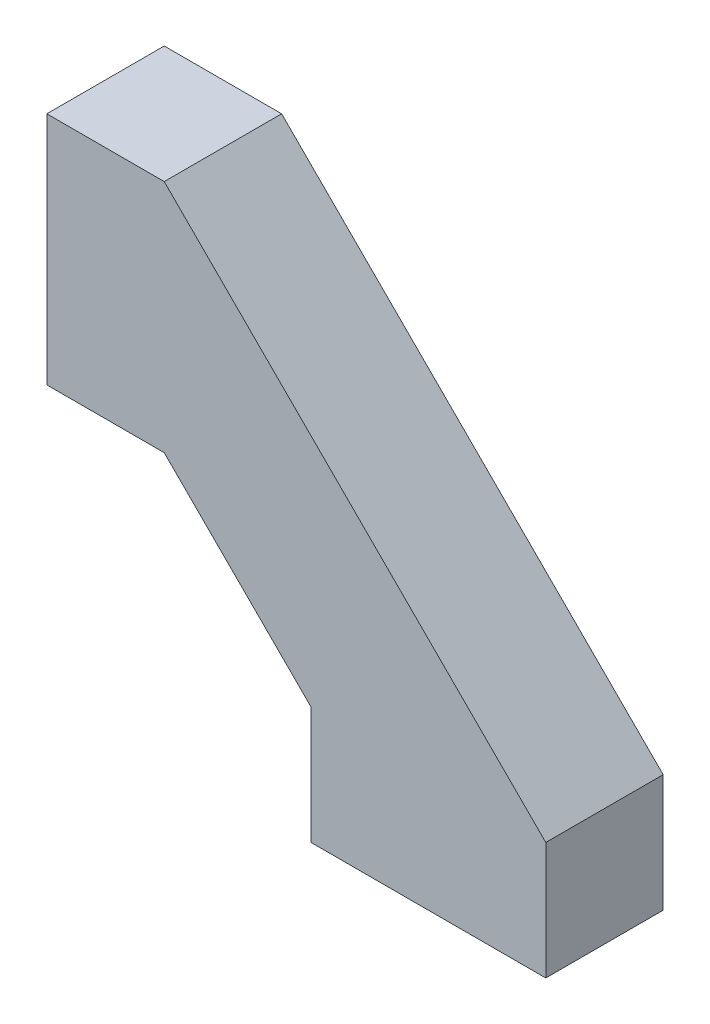
ISO-10303-21;
HEADER;
FILE_DESCRIPTION(('STEP AP214'),'2;1');
FILE_NAME('part.step','',(''),(''),'','','');
FILE_SCHEMA(('AUTOMOTIVE_DESIGN { 1 0 10303 214 1 1 1 1 }'));
ENDSEC;
DATA;
#1=APPLICATION_CONTEXT('core data for automotive mechanical design processes');
#2=APPLICATION_PROTOCOL_DEFINITION('international standard','automotive_design',2000,#1);
#3=PRODUCT_CONTEXT('',#1,'mechanical');
#4=PRODUCT('Part','Part','',(#3));
#5=PRODUCT_RELATED_PRODUCT_CATEGORY('part','',(#4));
#6=PRODUCT_DEFINITION_FORMATION('','',#4);
#7=PRODUCT_DEFINITION_CONTEXT('part definition',#1,'design');
#8=PRODUCT_DEFINITION('design','',#6,#7);
#9=PRODUCT_DEFINITION_SHAPE('','',#8);
#10=(LENGTH_UNIT() NAMED_UNIT(*) SI_UNIT(.MILLI.,.METRE.));
#11=(NAMED_UNIT(*) PLANE_ANGLE_UNIT() SI_UNIT($,.RADIAN.));
#12=(NAMED_UNIT(*) SI_UNIT($,.STERADIAN.) SOLID_ANGLE_UNIT());
#13=UNCERTAINTY_MEASURE_WITH_UNIT(LENGTH_MEASURE(1.E-05),#10,'distance_accuracy_value','');
#14=(GEOMETRIC_REPRESENTATION_CONTEXT(3) GLOBAL_UNCERTAINTY_ASSIGNED_CONTEXT((#13)) GLOBAL_UNIT_ASSIGNED_CONTEXT((#10,
#11,#12)) REPRESENTATION_CONTEXT('',''));
#15=CARTESIAN_POINT('',(0.,0.,0.));
#16=DIRECTION('',(0.,0.,1.));
#17=DIRECTION('',(1.,0.,0.));
#18=AXIS2_PLACEMENT_3D('',#15,#16,#17);
#19=CARTESIAN_POINT('',(2.,2.00000000000001,4.));
#20=DIRECTION('',(-0.707106781186546,-0.707106781186549,0.));
#21=DIRECTION('',(0.707106781186549,-0.707106781186546,0.));
#22=AXIS2_PLACEMENT_3D('',#19,#20,#21);
#23=PLANE('',#22);
#24=DIRECTION('',(-0.707106781186549,0.707106781186546,0.));
#25=VECTOR('',#24,1.);
#26=CARTESIAN_POINT('',(2.,2.00000000000001,0.));
#27=LINE('',#26,#25);
#28=CARTESIAN_POINT('',(0.,4.,0.));
#29=VERTEX_POINT('',#28);
#30=CARTESIAN_POINT('',(-13.,17.,0.));
#31=VERTEX_POINT('',#30);
#32=EDGE_CURVE('E130',#29,#31,#27,.T.);
#33=ORIENTED_EDGE('',*,*,#32,.T.);
#34=DIRECTION('',(0.,0.,-1.));
#35=VECTOR('',#34,1.);
#36=CARTESIAN_POINT('',(-13.,17.,4.));
#37=LINE('',#36,#35);
#38=CARTESIAN_POINT('',(-13.,17.,4.));
#39=VERTEX_POINT('',#38);
#40=EDGE_CURVE('E11',#39,#31,#37,.T.);
#41=ORIENTED_EDGE('',*,*,#40,.F.);
#42=DIRECTION('',(-0.707106781186549,0.707106781186546,0.));
#43=VECTOR('',#42,1.);
#44=CARTESIAN_POINT('',(2.,2.00000000000001,4.));
#45=LINE('',#44,#43);
#46=CARTESIAN_POINT('',(0.,4.,4.));
#47=VERTEX_POINT('',#46);
#48=EDGE_CURVE('E88',#47,#39,#45,.T.);
#49=ORIENTED_EDGE('',*,*,#48,.F.);
#50=DIRECTION('',(0.,0.,-1.));
#51=VECTOR('',#50,1.);
#52=CARTESIAN_POINT('',(0.,4.,4.));
#53=LINE('',#52,#51);
#54=EDGE_CURVE('E126',#47,#29,#53,.T.);
#55=ORIENTED_EDGE('',*,*,#54,.T.);
#56=EDGE_LOOP('',(#33,#41,#49,#55));
#57=FACE_BOUND('',#56,.T.);
#58=ADVANCED_FACE('F36',(#57),#23,.F.);
#59=CARTESIAN_POINT('',(0.,17.,4.));
#60=DIRECTION('',(0.,1.,0.));
#61=DIRECTION('',(0.,0.,1.));
#62=AXIS2_PLACEMENT_3D('',#59,#60,#61);
#63=PLANE('',#62);
#64=DIRECTION('',(1.,0.,0.));
#65=VECTOR('',#64,1.);
#66=CARTESIAN_POINT('',(0.,17.,0.));
#67=LINE('',#66,#65);
#68=CARTESIAN_POINT('',(-17.,17.,0.));
#69=VERTEX_POINT('',#68);
#70=EDGE_CURVE('E133',#69,#31,#67,.T.);
#71=ORIENTED_EDGE('',*,*,#70,.F.);
#72=DIRECTION('',(0.,0.,-1.));
#73=VECTOR('',#72,1.);
#74=CARTESIAN_POINT('',(-17.,17.,4.));
#75=LINE('',#74,#73);
#76=CARTESIAN_POINT('',(-17.,17.,4.));
#77=VERTEX_POINT('',#76);
#78=EDGE_CURVE('E44',#77,#69,#75,.T.);
#79=ORIENTED_EDGE('',*,*,#78,.F.);
#80=DIRECTION('',(1.,0.,0.));
#81=VECTOR('',#80,1.);
#82=CARTESIAN_POINT('',(0.,17.,4.));
#83=LINE('',#82,#81);
#84=EDGE_CURVE('E174',#77,#39,#83,.T.);
#85=ORIENTED_EDGE('',*,*,#84,.T.);
#86=ORIENTED_EDGE('',*,*,#40,.T.);
#87=EDGE_LOOP('',(#71,#79,#85,#86));
#88=FACE_BOUND('',#87,.T.);
#89=ADVANCED_FACE('F164',(#88),#63,.T.);
#90=CARTESIAN_POINT('',(-17.,0.,4.));
#91=DIRECTION('',(-1.,0.,0.));
#92=DIRECTION('',(0.,-1.,0.));
#93=AXIS2_PLACEMENT_3D('',#90,#91,#92);
#94=PLANE('',#93);
#95=DIRECTION('',(0.,1.,0.));
#96=VECTOR('',#95,1.);
#97=CARTESIAN_POINT('',(-17.,0.,0.));
#98=LINE('',#97,#96);
#99=CARTESIAN_POINT('',(-17.,9.,0.));
#100=VERTEX_POINT('',#99);
#101=EDGE_CURVE('E136',#100,#69,#98,.T.);
#102=ORIENTED_EDGE('',*,*,#101,.F.);
#103=DIRECTION('',(0.,0.,-1.));
#104=VECTOR('',#103,1.);
#105=CARTESIAN_POINT('',(-17.,9.,4.));
#106=LINE('',#105,#104);
#107=CARTESIAN_POINT('',(-17.,9.,4.));
#108=VERTEX_POINT('',#107);
#109=EDGE_CURVE('E154',#108,#100,#106,.T.);
#110=ORIENTED_EDGE('',*,*,#109,.F.);
#111=DIRECTION('',(0.,1.,0.));
#112=VECTOR('',#111,1.);
#113=CARTESIAN_POINT('',(-17.,0.,4.));
#114=LINE('',#113,#112);
#115=EDGE_CURVE('E161',#108,#77,#114,.T.);
#116=ORIENTED_EDGE('',*,*,#115,.T.);
#117=ORIENTED_EDGE('',*,*,#78,.T.);
#118=EDGE_LOOP('',(#102,#110,#116,#117));
#119=FACE_BOUND('',#118,.T.);
#120=ADVANCED_FACE('F159',(#119),#94,.T.);
#121=CARTESIAN_POINT('',(0.,9.,4.));
#122=DIRECTION('',(0.,-1.,0.));
#123=DIRECTION('',(1.,0.,0.));
#124=AXIS2_PLACEMENT_3D('',#121,#122,#123);
#125=PLANE('',#124);
#126=DIRECTION('',(-1.,0.,0.));
#127=VECTOR('',#126,1.);
#128=CARTESIAN_POINT('',(0.,9.,0.));
#129=LINE('',#128,#127);
#130=CARTESIAN_POINT('',(-13.,9.,0.));
#131=VERTEX_POINT('',#130);
#132=EDGE_CURVE('E139',#131,#100,#129,.T.);
#133=ORIENTED_EDGE('',*,*,#132,.F.);
#134=DIRECTION('',(0.,0.,-1.));
#135=VECTOR('',#134,1.);
#136=CARTESIAN_POINT('',(-13.,9.,4.));
#137=LINE('',#136,#135);
#138=CARTESIAN_POINT('',(-13.,9.,4.));
#139=VERTEX_POINT('',#138);
#140=EDGE_CURVE('E152',#139,#131,#137,.T.);
#141=ORIENTED_EDGE('',*,*,#140,.F.);
#142=DIRECTION('',(-1.,0.,0.));
#143=VECTOR('',#142,1.);
#144=CARTESIAN_POINT('',(0.,9.,4.));
#145=LINE('',#144,#143);
#146=EDGE_CURVE('E173',#139,#108,#145,.T.);
#147=ORIENTED_EDGE('',*,*,#146,.T.);
#148=ORIENTED_EDGE('',*,*,#109,.T.);
#149=EDGE_LOOP('',(#133,#141,#147,#148));
#150=FACE_BOUND('',#149,.T.);
#151=ADVANCED_FACE('F171',(#150),#125,.T.);
#152=CARTESIAN_POINT('',(-1.99999999999999,-1.99999999999999,4.));
#153=DIRECTION('',(-0.707106781186546,-0.707106781186549,0.));
#154=DIRECTION('',(0.707106781186549,-0.707106781186546,0.));
#155=AXIS2_PLACEMENT_3D('',#152,#153,#154);
#156=PLANE('',#155);
#157=DIRECTION('',(-0.707106781186549,0.707106781186546,0.));
#158=VECTOR('',#157,1.);
#159=CARTESIAN_POINT('',(-1.99999999999999,-1.99999999999999,0.));
#160=LINE('',#159,#158);
#161=CARTESIAN_POINT('',(-8.,4.,0.));
#162=VERTEX_POINT('',#161);
#163=EDGE_CURVE('E142',#162,#131,#160,.T.);
#164=ORIENTED_EDGE('',*,*,#163,.F.);
#165=DIRECTION('',(0.,0.,-1.));
#166=VECTOR('',#165,1.);
#167=CARTESIAN_POINT('',(-8.,4.,4.));
#168=LINE('',#167,#166);
#169=CARTESIAN_POINT('',(-8.,4.,4.));
#170=VERTEX_POINT('',#169);
#171=EDGE_CURVE('E115',#170,#162,#168,.T.);
#172=ORIENTED_EDGE('',*,*,#171,.F.);
#173=DIRECTION('',(-0.707106781186549,0.707106781186546,0.));
#174=VECTOR('',#173,1.);
#175=CARTESIAN_POINT('',(-1.99999999999999,-1.99999999999999,4.));
#176=LINE('',#175,#174);
#177=EDGE_CURVE('E122',#170,#139,#176,.T.);
#178=ORIENTED_EDGE('',*,*,#177,.T.);
#179=ORIENTED_EDGE('',*,*,#140,.T.);
#180=EDGE_LOOP('',(#164,#172,#178,#179));
#181=FACE_BOUND('',#180,.T.);
#182=ADVANCED_FACE('F180',(#181),#156,.T.);
#183=CARTESIAN_POINT('',(-8.,0.,4.));
#184=DIRECTION('',(-1.,0.,0.));
#185=DIRECTION('',(0.,0.,1.));
#186=AXIS2_PLACEMENT_3D('',#183,#184,#185);
#187=PLANE('',#186);
#188=DIRECTION('',(0.,1.,0.));
#189=VECTOR('',#188,1.);
#190=CARTESIAN_POINT('',(-8.,0.,0.));
#191=LINE('',#190,#189);
#192=CARTESIAN_POINT('',(-8.,0.,0.));
#193=VERTEX_POINT('',#192);
#194=EDGE_CURVE('E110',#193,#162,#191,.T.);
#195=ORIENTED_EDGE('',*,*,#194,.F.);
#196=DIRECTION('',(0.,0.,-1.));
#197=VECTOR('',#196,1.);
#198=CARTESIAN_POINT('',(-8.,0.,4.));
#199=LINE('',#198,#197);
#200=CARTESIAN_POINT('',(-8.,0.,4.));
#201=VERTEX_POINT('',#200);
#202=EDGE_CURVE('E105',#201,#193,#199,.T.);
#203=ORIENTED_EDGE('',*,*,#202,.F.);
#204=DIRECTION('',(0.,1.,0.));
#205=VECTOR('',#204,1.);
#206=CARTESIAN_POINT('',(-8.,0.,4.));
#207=LINE('',#206,#205);
#208=EDGE_CURVE('E108',#201,#170,#207,.T.);
#209=ORIENTED_EDGE('',*,*,#208,.T.);
#210=ORIENTED_EDGE('',*,*,#171,.T.);
#211=EDGE_LOOP('',(#195,#203,#209,#210));
#212=FACE_BOUND('',#211,.T.);
#213=ADVANCED_FACE('F107',(#212),#187,.T.);
#214=CARTESIAN_POINT('',(0.,0.,4.));
#215=DIRECTION('',(0.,-1.,0.));
#216=DIRECTION('',(0.,0.,-1.));
#217=AXIS2_PLACEMENT_3D('',#214,#215,#216);
#218=PLANE('',#217);
#219=DIRECTION('',(-1.,0.,0.));
#220=VECTOR('',#219,1.);
#221=CARTESIAN_POINT('',(0.,0.,0.));
#222=LINE('',#221,#220);
#223=CARTESIAN_POINT('',(0.,0.,0.));
#224=VERTEX_POINT('',#223);
#225=EDGE_CURVE('E146',#224,#193,#222,.T.);
#226=ORIENTED_EDGE('',*,*,#225,.F.);
#227=DIRECTION('',(0.,0.,-1.));
#228=VECTOR('',#227,1.);
#229=CARTESIAN_POINT('',(0.,0.,4.));
#230=LINE('',#229,#228);
#231=CARTESIAN_POINT('',(0.,0.,4.));
#232=VERTEX_POINT('',#231);
#233=EDGE_CURVE('E79',#232,#224,#230,.T.);
#234=ORIENTED_EDGE('',*,*,#233,.F.);
#235=DIRECTION('',(-1.,0.,0.));
#236=VECTOR('',#235,1.);
#237=CARTESIAN_POINT('',(0.,0.,4.));
#238=LINE('',#237,#236);
#239=EDGE_CURVE('E119',#232,#201,#238,.T.);
#240=ORIENTED_EDGE('',*,*,#239,.T.);
#241=ORIENTED_EDGE('',*,*,#202,.T.);
#242=EDGE_LOOP('',(#226,#234,#240,#241));
#243=FACE_BOUND('',#242,.T.);
#244=ADVANCED_FACE('F124',(#243),#218,.T.);
#245=CARTESIAN_POINT('',(0.,0.,4.));
#246=DIRECTION('',(-1.,0.,0.));
#247=DIRECTION('',(0.,0.,1.));
#248=AXIS2_PLACEMENT_3D('',#245,#246,#247);
#249=PLANE('',#248);
#250=DIRECTION('',(0.,1.,0.));
#251=VECTOR('',#250,1.);
#252=CARTESIAN_POINT('',(0.,0.,0.));
#253=LINE('',#252,#251);
#254=EDGE_CURVE('E82',#224,#29,#253,.T.);
#255=ORIENTED_EDGE('',*,*,#254,.T.);
#256=ORIENTED_EDGE('',*,*,#54,.F.);
#257=DIRECTION('',(0.,1.,0.));
#258=VECTOR('',#257,1.);
#259=CARTESIAN_POINT('',(0.,0.,4.));
#260=LINE('',#259,#258);
#261=EDGE_CURVE('E52',#232,#47,#260,.T.);
#262=ORIENTED_EDGE('',*,*,#261,.F.);
#263=ORIENTED_EDGE('',*,*,#233,.T.);
#264=EDGE_LOOP('',(#255,#256,#262,#263));
#265=FACE_BOUND('',#264,.T.);
#266=ADVANCED_FACE('F182',(#265),#249,.F.);
#267=CARTESIAN_POINT('',(0.,0.,4.));
#268=DIRECTION('',(0.,0.,1.));
#269=DIRECTION('',(1.,0.,0.));
#270=AXIS2_PLACEMENT_3D('',#267,#268,#269);
#271=PLANE('',#270);
#272=ORIENTED_EDGE('',*,*,#48,.T.);
#273=ORIENTED_EDGE('',*,*,#84,.F.);
#274=ORIENTED_EDGE('',*,*,#115,.F.);
#275=ORIENTED_EDGE('',*,*,#146,.F.);
#276=ORIENTED_EDGE('',*,*,#177,.F.);
#277=ORIENTED_EDGE('',*,*,#208,.F.);
#278=ORIENTED_EDGE('',*,*,#239,.F.);
#279=ORIENTED_EDGE('',*,*,#261,.T.);
#280=EDGE_LOOP('',(#272,#273,#274,#275,#276,#277,#278,#279));
#281=FACE_BOUND('',#280,.T.);
#282=ADVANCED_FACE('F118',(#281),#271,.T.);
#283=CARTESIAN_POINT('',(0.,0.,0.));
#284=DIRECTION('',(0.,0.,1.));
#285=DIRECTION('',(1.,0.,0.));
#286=AXIS2_PLACEMENT_3D('',#283,#284,#285);
#287=PLANE('',#286);
#288=ORIENTED_EDGE('',*,*,#32,.F.);
#289=ORIENTED_EDGE('',*,*,#254,.F.);
#290=ORIENTED_EDGE('',*,*,#225,.T.);
#291=ORIENTED_EDGE('',*,*,#194,.T.);
#292=ORIENTED_EDGE('',*,*,#163,.T.);
#293=ORIENTED_EDGE('',*,*,#132,.T.);
#294=ORIENTED_EDGE('',*,*,#101,.T.);
#295=ORIENTED_EDGE('',*,*,#70,.T.);
#296=EDGE_LOOP('',(#288,#289,#290,#291,#292,#293,#294,#295));
#297=FACE_BOUND('',#296,.T.);
#298=ADVANCED_FACE('F167',(#297),#287,.F.);
#299=CLOSED_SHELL('',(#58,#89,#120,#151,#182,#213,#244,#266,#282,#298));
#300=MANIFOLD_SOLID_BREP('B2',#299);
#301=ADVANCED_BREP_SHAPE_REPRESENTATION('',(#18,#300),#14);
#302=SHAPE_DEFINITION_REPRESENTATION(#9,#301);
ENDSEC;
END-ISO-10303-21;
